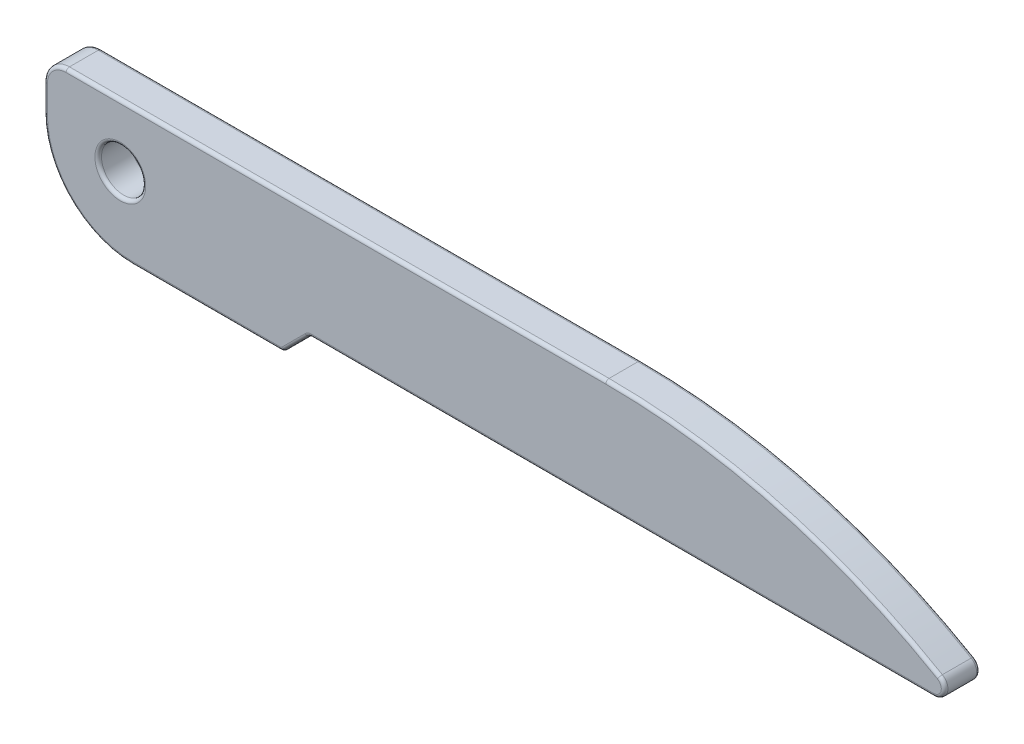
ISO-10303-21;
HEADER;
FILE_DESCRIPTION(('STEP AP214'),'2;1');
FILE_NAME('part.step','',(''),(''),'','','');
FILE_SCHEMA(('AUTOMOTIVE_DESIGN { 1 0 10303 214 1 1 1 1 }'));
ENDSEC;
DATA;
#1=APPLICATION_CONTEXT('core data for automotive mechanical design processes');
#2=APPLICATION_PROTOCOL_DEFINITION('international standard','automotive_design',2000,#1);
#3=PRODUCT_CONTEXT('',#1,'mechanical');
#4=PRODUCT('Part','Part','',(#3));
#5=PRODUCT_RELATED_PRODUCT_CATEGORY('part','',(#4));
#6=PRODUCT_DEFINITION_FORMATION('','',#4);
#7=PRODUCT_DEFINITION_CONTEXT('part definition',#1,'design');
#8=PRODUCT_DEFINITION('design','',#6,#7);
#9=PRODUCT_DEFINITION_SHAPE('','',#8);
#10=(LENGTH_UNIT() NAMED_UNIT(*) SI_UNIT(.MILLI.,.METRE.));
#11=(NAMED_UNIT(*) PLANE_ANGLE_UNIT() SI_UNIT($,.RADIAN.));
#12=(NAMED_UNIT(*) SI_UNIT($,.STERADIAN.) SOLID_ANGLE_UNIT());
#13=UNCERTAINTY_MEASURE_WITH_UNIT(LENGTH_MEASURE(1.E-05),#10,'distance_accuracy_value','');
#14=(GEOMETRIC_REPRESENTATION_CONTEXT(3) GLOBAL_UNCERTAINTY_ASSIGNED_CONTEXT((#13)) GLOBAL_UNIT_ASSIGNED_CONTEXT((#10,
#11,#12)) REPRESENTATION_CONTEXT('',''));
#15=CARTESIAN_POINT('',(0.,0.,0.));
#16=DIRECTION('',(0.,0.,1.));
#17=DIRECTION('',(1.,0.,0.));
#18=AXIS2_PLACEMENT_3D('',#15,#16,#17);
#19=CARTESIAN_POINT('',(25.416876048223,-23.8,1.6));
#20=DIRECTION('',(0.,0.,-1.));
#21=DIRECTION('',(-1.,0.,0.));
#22=AXIS2_PLACEMENT_3D('',#19,#20,#21);
#23=PLANE('',#22);
#24=CARTESIAN_POINT('',(3.45,3.4,1.6));
#25=DIRECTION('',(0.,0.,-1.));
#26=DIRECTION('',(-1.,0.,0.));
#27=AXIS2_PLACEMENT_3D('',#24,#25,#26);
#28=CIRCLE('',#27,1.15);
#29=CARTESIAN_POINT('',(2.3,3.4,1.6));
#30=VERTEX_POINT('',#29);
#31=EDGE_CURVE('E11',#30,#30,#28,.T.);
#32=ORIENTED_EDGE('',*,*,#31,.T.);
#33=EDGE_LOOP('',(#32));
#34=FACE_BOUND('',#33,.T.);
#35=CARTESIAN_POINT('',(1.,5.2,1.6));
#36=DIRECTION('',(0.,0.,-1.));
#37=DIRECTION('',(-1.,0.,0.));
#38=AXIS2_PLACEMENT_3D('',#35,#36,#37);
#39=CIRCLE('',#38,0.85);
#40=CARTESIAN_POINT('',(0.150000000000001,5.2,1.6));
#41=VERTEX_POINT('',#40);
#42=CARTESIAN_POINT('',(1.,6.05,1.6));
#43=VERTEX_POINT('',#42);
#44=EDGE_CURVE('E543',#41,#43,#39,.T.);
#45=ORIENTED_EDGE('',*,*,#44,.F.);
#46=DIRECTION('',(0.,-1.,0.));
#47=VECTOR('',#46,1.);
#48=CARTESIAN_POINT('',(0.150000000000001,-23.8,1.6));
#49=LINE('',#48,#47);
#50=CARTESIAN_POINT('',(0.150000000000001,4.,1.6));
#51=VERTEX_POINT('',#50);
#52=EDGE_CURVE('E201',#41,#51,#49,.T.);
#53=ORIENTED_EDGE('',*,*,#52,.T.);
#54=CARTESIAN_POINT('',(4.,4.,1.6));
#55=DIRECTION('',(0.,0.,-1.));
#56=DIRECTION('',(-1.,0.,0.));
#57=AXIS2_PLACEMENT_3D('',#54,#55,#56);
#58=CIRCLE('',#57,3.85);
#59=CARTESIAN_POINT('',(4.,0.150000000000001,1.6));
#60=VERTEX_POINT('',#59);
#61=EDGE_CURVE('E858',#60,#51,#58,.T.);
#62=ORIENTED_EDGE('',*,*,#61,.F.);
#63=DIRECTION('',(1.,0.,0.));
#64=VECTOR('',#63,1.);
#65=CARTESIAN_POINT('',(25.416876048223,0.150000000000001,1.6));
#66=LINE('',#65,#64);
#67=CARTESIAN_POINT('',(10.6964466094067,0.150000000000001,1.6));
#68=VERTEX_POINT('',#67);
#69=EDGE_CURVE('E297',#60,#68,#66,.T.);
#70=ORIENTED_EDGE('',*,*,#69,.T.);
#71=CARTESIAN_POINT('',(10.6964466094067,0.25,1.6));
#72=DIRECTION('',(0.,0.,-1.));
#73=DIRECTION('',(-1.,0.,0.));
#74=AXIS2_PLACEMENT_3D('',#71,#72,#73);
#75=CIRCLE('',#74,0.1);
#76=CARTESIAN_POINT('',(10.7671572875254,0.179289321881345,1.6));
#77=VERTEX_POINT('',#76);
#78=EDGE_CURVE('E299',#68,#77,#75,.F.);
#79=ORIENTED_EDGE('',*,*,#78,.T.);
#80=DIRECTION('',(0.707106781186546,0.707106781186549,0.));
#81=VECTOR('',#80,1.);
#82=CARTESIAN_POINT('',(6.1023720069335,-4.48549595871057,1.6));
#83=LINE('',#82,#81);
#84=CARTESIAN_POINT('',(11.8207106781187,1.23284271247461,1.6));
#85=VERTEX_POINT('',#84);
#86=EDGE_CURVE('E301',#77,#85,#83,.T.);
#87=ORIENTED_EDGE('',*,*,#86,.T.);
#88=CARTESIAN_POINT('',(12.1035533905933,0.949999999999996,1.6));
#89=DIRECTION('',(0.,0.,-1.));
#90=DIRECTION('',(-1.,0.,0.));
#91=AXIS2_PLACEMENT_3D('',#88,#89,#90);
#92=CIRCLE('',#91,0.4);
#93=CARTESIAN_POINT('',(12.1035533905933,1.35,1.6));
#94=VERTEX_POINT('',#93);
#95=EDGE_CURVE('E303',#85,#94,#92,.T.);
#96=ORIENTED_EDGE('',*,*,#95,.T.);
#97=DIRECTION('',(1.,0.,0.));
#98=VECTOR('',#97,1.);
#99=CARTESIAN_POINT('',(25.416876048223,1.35,1.6));
#100=LINE('',#99,#98);
#101=CARTESIAN_POINT('',(40.2492730224143,1.35,1.6));
#102=VERTEX_POINT('',#101);
#103=EDGE_CURVE('E305',#94,#102,#100,.T.);
#104=ORIENTED_EDGE('',*,*,#103,.T.);
#105=CARTESIAN_POINT('',(40.2492730224143,1.7,1.6));
#106=DIRECTION('',(0.,0.,-1.));
#107=DIRECTION('',(-1.,0.,0.));
#108=AXIS2_PLACEMENT_3D('',#105,#106,#107);
#109=CIRCLE('',#108,0.35);
#110=CARTESIAN_POINT('',(40.4252506136336,2.00254237288135,1.6));
#111=VERTEX_POINT('',#110);
#112=EDGE_CURVE('E307',#102,#111,#109,.F.);
#113=ORIENTED_EDGE('',*,*,#112,.T.);
#114=CARTESIAN_POINT('',(25.416876048223,-23.8,1.6));
#115=DIRECTION('',(0.,0.,-1.));
#116=DIRECTION('',(-1.,0.,0.));
#117=AXIS2_PLACEMENT_3D('',#114,#115,#116);
#118=CIRCLE('',#117,29.85);
#119=CARTESIAN_POINT('',(25.416876048223,6.05,1.6));
#120=VERTEX_POINT('',#119);
#121=EDGE_CURVE('E309',#111,#120,#118,.F.);
#122=ORIENTED_EDGE('',*,*,#121,.T.);
#123=DIRECTION('',(-1.,0.,0.));
#124=VECTOR('',#123,1.);
#125=CARTESIAN_POINT('',(25.416876048223,6.05,1.6));
#126=LINE('',#125,#124);
#127=EDGE_CURVE('E311',#120,#43,#126,.T.);
#128=ORIENTED_EDGE('',*,*,#127,.T.);
#129=EDGE_LOOP('',(#45,#53,#62,#70,#79,#87,#96,#104,#113,#122,#128));
#130=FACE_BOUND('',#129,.T.);
#131=ADVANCED_FACE('F36',(#34,#130),#23,.F.);
#132=CARTESIAN_POINT('',(25.416876048223,-23.8,0.));
#133=DIRECTION('',(0.,0.,-1.));
#134=DIRECTION('',(-1.,0.,0.));
#135=AXIS2_PLACEMENT_3D('',#132,#133,#134);
#136=PLANE('',#135);
#137=CARTESIAN_POINT('',(3.45,3.4,0.));
#138=DIRECTION('',(0.,0.,-1.));
#139=DIRECTION('',(-1.,0.,0.));
#140=AXIS2_PLACEMENT_3D('',#137,#138,#139);
#141=CIRCLE('',#140,1.15);
#142=CARTESIAN_POINT('',(2.3,3.4,0.));
#143=VERTEX_POINT('',#142);
#144=EDGE_CURVE('E44',#143,#143,#141,.F.);
#145=ORIENTED_EDGE('',*,*,#144,.T.);
#146=EDGE_LOOP('',(#145));
#147=FACE_BOUND('',#146,.T.);
#148=CARTESIAN_POINT('',(22.416876048223,19.2977270848675,0.));
#149=DIRECTION('',(0.,0.,-1.));
#150=DIRECTION('',(-1.,0.,0.));
#151=AXIS2_PLACEMENT_3D('',#148,#149,#150);
#152=CIRCLE('',#151,15.);
#153=CARTESIAN_POINT('',(28.416876048223,5.55,0.));
#154=VERTEX_POINT('',#153);
#155=CARTESIAN_POINT('',(16.416876048223,5.55,0.));
#156=VERTEX_POINT('',#155);
#157=EDGE_CURVE('E197',#154,#156,#152,.T.);
#158=ORIENTED_EDGE('',*,*,#157,.F.);
#159=DIRECTION('',(1.,0.,0.));
#160=VECTOR('',#159,1.);
#161=CARTESIAN_POINT('',(16.416876048223,5.55,0.));
#162=LINE('',#161,#160);
#163=EDGE_CURVE('E203',#156,#154,#162,.T.);
#164=ORIENTED_EDGE('',*,*,#163,.F.);
#165=EDGE_LOOP('',(#158,#164));
#166=FACE_BOUND('',#165,.T.);
#167=CARTESIAN_POINT('',(1.,5.2,0.));
#168=DIRECTION('',(0.,0.,-1.));
#169=DIRECTION('',(-1.,0.,0.));
#170=AXIS2_PLACEMENT_3D('',#167,#168,#169);
#171=CIRCLE('',#170,0.85);
#172=CARTESIAN_POINT('',(1.,6.05,0.));
#173=VERTEX_POINT('',#172);
#174=CARTESIAN_POINT('',(0.15,5.2,0.));
#175=VERTEX_POINT('',#174);
#176=EDGE_CURVE('E528',#173,#175,#171,.F.);
#177=ORIENTED_EDGE('',*,*,#176,.F.);
#178=DIRECTION('',(-1.,0.,0.));
#179=VECTOR('',#178,1.);
#180=CARTESIAN_POINT('',(25.416876048223,6.05,0.));
#181=LINE('',#180,#179);
#182=CARTESIAN_POINT('',(25.416876048223,6.05,0.));
#183=VERTEX_POINT('',#182);
#184=EDGE_CURVE('E248',#173,#183,#181,.F.);
#185=ORIENTED_EDGE('',*,*,#184,.T.);
#186=CARTESIAN_POINT('',(25.416876048223,-23.8,0.));
#187=DIRECTION('',(0.,0.,-1.));
#188=DIRECTION('',(-1.,0.,0.));
#189=AXIS2_PLACEMENT_3D('',#186,#187,#188);
#190=CIRCLE('',#189,29.85);
#191=CARTESIAN_POINT('',(40.4252506136336,2.00254237288136,0.));
#192=VERTEX_POINT('',#191);
#193=EDGE_CURVE('E250',#183,#192,#190,.T.);
#194=ORIENTED_EDGE('',*,*,#193,.T.);
#195=CARTESIAN_POINT('',(40.2492730224143,1.7,0.));
#196=DIRECTION('',(0.,0.,-1.));
#197=DIRECTION('',(-1.,0.,0.));
#198=AXIS2_PLACEMENT_3D('',#195,#196,#197);
#199=CIRCLE('',#198,0.35);
#200=CARTESIAN_POINT('',(40.2492730224143,1.35,0.));
#201=VERTEX_POINT('',#200);
#202=EDGE_CURVE('E252',#192,#201,#199,.T.);
#203=ORIENTED_EDGE('',*,*,#202,.T.);
#204=DIRECTION('',(1.,0.,0.));
#205=VECTOR('',#204,1.);
#206=CARTESIAN_POINT('',(12.1035533905933,1.35,0.));
#207=LINE('',#206,#205);
#208=CARTESIAN_POINT('',(12.1035533905933,1.35,0.));
#209=VERTEX_POINT('',#208);
#210=EDGE_CURVE('E254',#201,#209,#207,.F.);
#211=ORIENTED_EDGE('',*,*,#210,.T.);
#212=CARTESIAN_POINT('',(12.1035533905933,0.949999999999996,0.));
#213=DIRECTION('',(0.,0.,-1.));
#214=DIRECTION('',(-1.,0.,0.));
#215=AXIS2_PLACEMENT_3D('',#212,#213,#214);
#216=CIRCLE('',#215,0.4);
#217=CARTESIAN_POINT('',(11.8207106781187,1.23284271247461,0.));
#218=VERTEX_POINT('',#217);
#219=EDGE_CURVE('E256',#209,#218,#216,.F.);
#220=ORIENTED_EDGE('',*,*,#219,.T.);
#221=DIRECTION('',(0.707106781186546,0.707106781186549,0.));
#222=VECTOR('',#221,1.);
#223=CARTESIAN_POINT('',(10.7671572875254,0.179289321881346,0.));
#224=LINE('',#223,#222);
#225=CARTESIAN_POINT('',(10.7671572875254,0.179289321881346,0.));
#226=VERTEX_POINT('',#225);
#227=EDGE_CURVE('E238',#218,#226,#224,.F.);
#228=ORIENTED_EDGE('',*,*,#227,.T.);
#229=CARTESIAN_POINT('',(10.6964466094067,0.25,0.));
#230=DIRECTION('',(0.,0.,-1.));
#231=DIRECTION('',(-1.,0.,0.));
#232=AXIS2_PLACEMENT_3D('',#229,#230,#231);
#233=CIRCLE('',#232,0.1);
#234=CARTESIAN_POINT('',(10.6964466094067,0.15,0.));
#235=VERTEX_POINT('',#234);
#236=EDGE_CURVE('E240',#226,#235,#233,.T.);
#237=ORIENTED_EDGE('',*,*,#236,.T.);
#238=DIRECTION('',(1.,0.,0.));
#239=VECTOR('',#238,1.);
#240=CARTESIAN_POINT('',(0.,0.15,0.));
#241=LINE('',#240,#239);
#242=CARTESIAN_POINT('',(4.,0.15,0.));
#243=VERTEX_POINT('',#242);
#244=EDGE_CURVE('E242',#235,#243,#241,.F.);
#245=ORIENTED_EDGE('',*,*,#244,.T.);
#246=CARTESIAN_POINT('',(4.,4.,0.));
#247=DIRECTION('',(0.,0.,-1.));
#248=DIRECTION('',(-1.,0.,0.));
#249=AXIS2_PLACEMENT_3D('',#246,#247,#248);
#250=CIRCLE('',#249,3.85);
#251=CARTESIAN_POINT('',(0.15,4.,0.));
#252=VERTEX_POINT('',#251);
#253=EDGE_CURVE('E200',#252,#243,#250,.F.);
#254=ORIENTED_EDGE('',*,*,#253,.F.);
#255=DIRECTION('',(0.,-1.,0.));
#256=VECTOR('',#255,1.);
#257=CARTESIAN_POINT('',(0.15,6.2,0.));
#258=LINE('',#257,#256);
#259=EDGE_CURVE('E245',#252,#175,#258,.F.);
#260=ORIENTED_EDGE('',*,*,#259,.T.);
#261=EDGE_LOOP('',(#177,#185,#194,#203,#211,#220,#228,#237,#245,#254,#260));
#262=FACE_BOUND('',#261,.T.);
#263=ADVANCED_FACE('F208',(#147,#166,#262),#136,.T.);
#264=CARTESIAN_POINT('',(10.8,0.,1.6));
#265=DIRECTION('',(0.,1.,0.));
#266=DIRECTION('',(-1.,0.,0.));
#267=AXIS2_PLACEMENT_3D('',#264,#265,#266);
#268=PLANE('',#267);
#269=DIRECTION('',(1.,0.,0.));
#270=VECTOR('',#269,1.);
#271=CARTESIAN_POINT('',(10.8,0.,1.45));
#272=LINE('',#271,#270);
#273=CARTESIAN_POINT('',(10.6964466094067,0.,1.45));
#274=VERTEX_POINT('',#273);
#275=CARTESIAN_POINT('',(4.,0.,1.45));
#276=VERTEX_POINT('',#275);
#277=EDGE_CURVE('E284',#274,#276,#272,.F.);
#278=ORIENTED_EDGE('',*,*,#277,.T.);
#279=DIRECTION('',(0.,0.,-1.));
#280=VECTOR('',#279,1.);
#281=CARTESIAN_POINT('',(4.,0.,1.6));
#282=LINE('',#281,#280);
#283=CARTESIAN_POINT('',(4.,0.,0.15));
#284=VERTEX_POINT('',#283);
#285=EDGE_CURVE('E538',#276,#284,#282,.T.);
#286=ORIENTED_EDGE('',*,*,#285,.T.);
#287=DIRECTION('',(1.,0.,0.));
#288=VECTOR('',#287,1.);
#289=CARTESIAN_POINT('',(10.6964466094067,0.,0.15));
#290=LINE('',#289,#288);
#291=CARTESIAN_POINT('',(10.6964466094067,0.,0.15));
#292=VERTEX_POINT('',#291);
#293=EDGE_CURVE('E287',#284,#292,#290,.T.);
#294=ORIENTED_EDGE('',*,*,#293,.T.);
#295=DIRECTION('',(0.,0.,-1.));
#296=VECTOR('',#295,1.);
#297=CARTESIAN_POINT('',(10.6964466094067,0.,1.6));
#298=LINE('',#297,#296);
#299=EDGE_CURVE('E232',#292,#274,#298,.F.);
#300=ORIENTED_EDGE('',*,*,#299,.T.);
#301=EDGE_LOOP('',(#278,#286,#294,#300));
#302=FACE_BOUND('',#301,.T.);
#303=ADVANCED_FACE('F374',(#302),#268,.F.);
#304=CARTESIAN_POINT('',(12.,1.2,1.6));
#305=DIRECTION('',(-0.707106781186549,0.707106781186546,0.));
#306=DIRECTION('',(-0.707106781186546,-0.707106781186549,0.));
#307=AXIS2_PLACEMENT_3D('',#304,#305,#306);
#308=PLANE('',#307);
#309=DIRECTION('',(0.,0.,-1.));
#310=VECTOR('',#309,1.);
#311=CARTESIAN_POINT('',(10.8732233047034,0.073223304703364,1.6));
#312=LINE('',#311,#310);
#313=CARTESIAN_POINT('',(10.8732233047034,0.073223304703364,1.45));
#314=VERTEX_POINT('',#313);
#315=CARTESIAN_POINT('',(10.8732233047034,0.073223304703364,0.15));
#316=VERTEX_POINT('',#315);
#317=EDGE_CURVE('E229',#314,#316,#312,.T.);
#318=ORIENTED_EDGE('',*,*,#317,.T.);
#319=DIRECTION('',(0.707106781186546,0.707106781186549,0.));
#320=VECTOR('',#319,1.);
#321=CARTESIAN_POINT('',(11.9267766952966,1.12677669529663,0.15));
#322=LINE('',#321,#320);
#323=CARTESIAN_POINT('',(11.9267766952966,1.12677669529663,0.15));
#324=VERTEX_POINT('',#323);
#325=EDGE_CURVE('E295',#316,#324,#322,.T.);
#326=ORIENTED_EDGE('',*,*,#325,.T.);
#327=DIRECTION('',(0.,0.,-1.));
#328=VECTOR('',#327,1.);
#329=CARTESIAN_POINT('',(11.9267766952966,1.12677669529663,1.6));
#330=LINE('',#329,#328);
#331=CARTESIAN_POINT('',(11.9267766952966,1.12677669529663,1.45));
#332=VERTEX_POINT('',#331);
#333=EDGE_CURVE('E226',#324,#332,#330,.F.);
#334=ORIENTED_EDGE('',*,*,#333,.T.);
#335=DIRECTION('',(0.707106781186546,0.707106781186549,0.));
#336=VECTOR('',#335,1.);
#337=CARTESIAN_POINT('',(12.,1.2,1.45));
#338=LINE('',#337,#336);
#339=EDGE_CURVE('E293',#332,#314,#338,.F.);
#340=ORIENTED_EDGE('',*,*,#339,.T.);
#341=EDGE_LOOP('',(#318,#326,#334,#340));
#342=FACE_BOUND('',#341,.T.);
#343=ADVANCED_FACE('F392',(#342),#308,.F.);
#344=CARTESIAN_POINT('',(42.,1.2,1.6));
#345=DIRECTION('',(0.,1.,0.));
#346=DIRECTION('',(-1.,0.,0.));
#347=AXIS2_PLACEMENT_3D('',#344,#345,#346);
#348=PLANE('',#347);
#349=DIRECTION('',(0.,0.,-1.));
#350=VECTOR('',#349,1.);
#351=CARTESIAN_POINT('',(12.1035533905933,1.2,0.));
#352=LINE('',#351,#350);
#353=CARTESIAN_POINT('',(12.1035533905933,1.2,1.45));
#354=VERTEX_POINT('',#353);
#355=CARTESIAN_POINT('',(12.1035533905933,1.2,0.15));
#356=VERTEX_POINT('',#355);
#357=EDGE_CURVE('E235',#354,#356,#352,.T.);
#358=ORIENTED_EDGE('',*,*,#357,.T.);
#359=DIRECTION('',(1.,0.,0.));
#360=VECTOR('',#359,1.);
#361=CARTESIAN_POINT('',(40.2492730224143,1.2,0.15));
#362=LINE('',#361,#360);
#363=CARTESIAN_POINT('',(40.2492730224143,1.2,0.15));
#364=VERTEX_POINT('',#363);
#365=EDGE_CURVE('E266',#356,#364,#362,.T.);
#366=ORIENTED_EDGE('',*,*,#365,.T.);
#367=DIRECTION('',(0.,0.,-1.));
#368=VECTOR('',#367,1.);
#369=CARTESIAN_POINT('',(40.2492730224143,1.2,1.6));
#370=LINE('',#369,#368);
#371=CARTESIAN_POINT('',(40.2492730224143,1.2,1.45));
#372=VERTEX_POINT('',#371);
#373=EDGE_CURVE('E223',#364,#372,#370,.F.);
#374=ORIENTED_EDGE('',*,*,#373,.T.);
#375=DIRECTION('',(1.,0.,0.));
#376=VECTOR('',#375,1.);
#377=CARTESIAN_POINT('',(42.,1.2,1.45));
#378=LINE('',#377,#376);
#379=EDGE_CURVE('E264',#372,#354,#378,.F.);
#380=ORIENTED_EDGE('',*,*,#379,.T.);
#381=EDGE_LOOP('',(#358,#366,#374,#380));
#382=FACE_BOUND('',#381,.T.);
#383=ADVANCED_FACE('F388',(#382),#348,.F.);
#384=CARTESIAN_POINT('',(25.416876048223,-23.8,1.6));
#385=DIRECTION('',(0.,0.,-1.));
#386=DIRECTION('',(-1.,0.,0.));
#387=AXIS2_PLACEMENT_3D('',#384,#385,#386);
#388=CYLINDRICAL_SURFACE('',#387,30.);
#389=DIRECTION('',(0.,0.,-1.));
#390=VECTOR('',#389,1.);
#391=CARTESIAN_POINT('',(40.5006695812989,2.13220338983051,1.6));
#392=LINE('',#391,#390);
#393=CARTESIAN_POINT('',(40.5006695812989,2.13220338983051,1.45));
#394=VERTEX_POINT('',#393);
#395=CARTESIAN_POINT('',(40.5006695812989,2.13220338983051,0.15));
#396=VERTEX_POINT('',#395);
#397=EDGE_CURVE('E219',#394,#396,#392,.T.);
#398=ORIENTED_EDGE('',*,*,#397,.T.);
#399=CARTESIAN_POINT('',(25.416876048223,-23.8,0.15));
#400=DIRECTION('',(0.,0.,-1.));
#401=DIRECTION('',(-1.,0.,0.));
#402=AXIS2_PLACEMENT_3D('',#399,#400,#401);
#403=CIRCLE('',#402,30.);
#404=CARTESIAN_POINT('',(25.416876048223,6.2,0.15));
#405=VERTEX_POINT('',#404);
#406=EDGE_CURVE('E274',#396,#405,#403,.F.);
#407=ORIENTED_EDGE('',*,*,#406,.T.);
#408=DIRECTION('',(0.,0.,-1.));
#409=VECTOR('',#408,1.);
#410=CARTESIAN_POINT('',(25.416876048223,6.2,1.6));
#411=LINE('',#410,#409);
#412=CARTESIAN_POINT('',(25.416876048223,6.2,1.45));
#413=VERTEX_POINT('',#412);
#414=EDGE_CURVE('E216',#413,#405,#411,.T.);
#415=ORIENTED_EDGE('',*,*,#414,.F.);
#416=CARTESIAN_POINT('',(25.416876048223,-23.8,1.45));
#417=DIRECTION('',(0.,0.,-1.));
#418=DIRECTION('',(-1.,0.,0.));
#419=AXIS2_PLACEMENT_3D('',#416,#417,#418);
#420=CIRCLE('',#419,30.);
#421=EDGE_CURVE('E272',#413,#394,#420,.T.);
#422=ORIENTED_EDGE('',*,*,#421,.T.);
#423=EDGE_LOOP('',(#398,#407,#415,#422));
#424=FACE_BOUND('',#423,.T.);
#425=ADVANCED_FACE('F384',(#424),#388,.T.);
#426=CARTESIAN_POINT('',(0.,6.2,1.6));
#427=DIRECTION('',(0.,-1.,0.));
#428=DIRECTION('',(1.,0.,0.));
#429=AXIS2_PLACEMENT_3D('',#426,#427,#428);
#430=PLANE('',#429);
#431=DIRECTION('',(-1.,0.,0.));
#432=VECTOR('',#431,1.);
#433=CARTESIAN_POINT('',(0.,6.2,0.15));
#434=LINE('',#433,#432);
#435=CARTESIAN_POINT('',(1.,6.2,0.15));
#436=VERTEX_POINT('',#435);
#437=EDGE_CURVE('E278',#405,#436,#434,.T.);
#438=ORIENTED_EDGE('',*,*,#437,.T.);
#439=DIRECTION('',(0.,0.,-1.));
#440=VECTOR('',#439,1.);
#441=CARTESIAN_POINT('',(1.,6.2,1.6));
#442=LINE('',#441,#440);
#443=CARTESIAN_POINT('',(1.,6.2,1.45));
#444=VERTEX_POINT('',#443);
#445=EDGE_CURVE('E550',#436,#444,#442,.F.);
#446=ORIENTED_EDGE('',*,*,#445,.T.);
#447=DIRECTION('',(-1.,0.,0.));
#448=VECTOR('',#447,1.);
#449=CARTESIAN_POINT('',(0.,6.2,1.45));
#450=LINE('',#449,#448);
#451=EDGE_CURVE('E276',#444,#413,#450,.F.);
#452=ORIENTED_EDGE('',*,*,#451,.T.);
#453=ORIENTED_EDGE('',*,*,#414,.T.);
#454=EDGE_LOOP('',(#438,#446,#452,#453));
#455=FACE_BOUND('',#454,.T.);
#456=ADVANCED_FACE('F380',(#455),#430,.F.);
#457=CARTESIAN_POINT('',(0.,0.,1.6));
#458=DIRECTION('',(1.,0.,0.));
#459=DIRECTION('',(0.,0.,-1.));
#460=AXIS2_PLACEMENT_3D('',#457,#458,#459);
#461=PLANE('',#460);
#462=DIRECTION('',(0.,-1.,0.));
#463=VECTOR('',#462,1.);
#464=CARTESIAN_POINT('',(0.,0.,1.45));
#465=LINE('',#464,#463);
#466=CARTESIAN_POINT('',(0.,4.,1.45));
#467=VERTEX_POINT('',#466);
#468=CARTESIAN_POINT('',(0.,5.2,1.45));
#469=VERTEX_POINT('',#468);
#470=EDGE_CURVE('E280',#467,#469,#465,.F.);
#471=ORIENTED_EDGE('',*,*,#470,.T.);
#472=DIRECTION('',(0.,0.,-1.));
#473=VECTOR('',#472,1.);
#474=CARTESIAN_POINT('',(0.,5.2,1.6));
#475=LINE('',#474,#473);
#476=CARTESIAN_POINT('',(0.,5.2,0.15));
#477=VERTEX_POINT('',#476);
#478=EDGE_CURVE('E548',#469,#477,#475,.T.);
#479=ORIENTED_EDGE('',*,*,#478,.T.);
#480=DIRECTION('',(0.,-1.,0.));
#481=VECTOR('',#480,1.);
#482=CARTESIAN_POINT('',(0.,0.,0.15));
#483=LINE('',#482,#481);
#484=CARTESIAN_POINT('',(0.,4.,0.15));
#485=VERTEX_POINT('',#484);
#486=EDGE_CURVE('E282',#477,#485,#483,.T.);
#487=ORIENTED_EDGE('',*,*,#486,.T.);
#488=DIRECTION('',(0.,0.,-1.));
#489=VECTOR('',#488,1.);
#490=CARTESIAN_POINT('',(0.,4.,1.6));
#491=LINE('',#490,#489);
#492=EDGE_CURVE('E534',#485,#467,#491,.F.);
#493=ORIENTED_EDGE('',*,*,#492,.T.);
#494=EDGE_LOOP('',(#471,#479,#487,#493));
#495=FACE_BOUND('',#494,.T.);
#496=ADVANCED_FACE('F376',(#495),#461,.F.);
#497=CARTESIAN_POINT('',(40.2492730224143,1.7,1.6));
#498=DIRECTION('',(0.,0.,-1.));
#499=DIRECTION('',(-1.,0.,0.));
#500=AXIS2_PLACEMENT_3D('',#497,#498,#499);
#501=CYLINDRICAL_SURFACE('',#500,0.5);
#502=ORIENTED_EDGE('',*,*,#373,.F.);
#503=CARTESIAN_POINT('',(40.2492730224143,1.7,0.15));
#504=DIRECTION('',(0.,0.,-1.));
#505=DIRECTION('',(-1.,0.,0.));
#506=AXIS2_PLACEMENT_3D('',#503,#504,#505);
#507=CIRCLE('',#506,0.5);
#508=EDGE_CURVE('E270',#364,#396,#507,.F.);
#509=ORIENTED_EDGE('',*,*,#508,.T.);
#510=ORIENTED_EDGE('',*,*,#397,.F.);
#511=CARTESIAN_POINT('',(40.2492730224143,1.7,1.45));
#512=DIRECTION('',(0.,0.,-1.));
#513=DIRECTION('',(-1.,0.,0.));
#514=AXIS2_PLACEMENT_3D('',#511,#512,#513);
#515=CIRCLE('',#514,0.5);
#516=EDGE_CURVE('E268',#394,#372,#515,.T.);
#517=ORIENTED_EDGE('',*,*,#516,.T.);
#518=EDGE_LOOP('',(#502,#509,#510,#517));
#519=FACE_BOUND('',#518,.T.);
#520=ADVANCED_FACE('F379',(#519),#501,.T.);
#521=CARTESIAN_POINT('',(10.6964466094067,0.25,1.6));
#522=DIRECTION('',(0.,0.,-1.));
#523=DIRECTION('',(-1.,0.,0.));
#524=AXIS2_PLACEMENT_3D('',#521,#522,#523);
#525=CYLINDRICAL_SURFACE('',#524,0.25);
#526=ORIENTED_EDGE('',*,*,#299,.F.);
#527=CARTESIAN_POINT('',(10.6964466094067,0.25,0.15));
#528=DIRECTION('',(0.,0.,-1.));
#529=DIRECTION('',(-1.,0.,0.));
#530=AXIS2_PLACEMENT_3D('',#527,#528,#529);
#531=CIRCLE('',#530,0.25);
#532=EDGE_CURVE('E291',#292,#316,#531,.F.);
#533=ORIENTED_EDGE('',*,*,#532,.T.);
#534=ORIENTED_EDGE('',*,*,#317,.F.);
#535=CARTESIAN_POINT('',(10.6964466094067,0.25,1.45));
#536=DIRECTION('',(0.,0.,-1.));
#537=DIRECTION('',(-1.,0.,0.));
#538=AXIS2_PLACEMENT_3D('',#535,#536,#537);
#539=CIRCLE('',#538,0.25);
#540=EDGE_CURVE('E289',#314,#274,#539,.T.);
#541=ORIENTED_EDGE('',*,*,#540,.T.);
#542=EDGE_LOOP('',(#526,#533,#534,#541));
#543=FACE_BOUND('',#542,.T.);
#544=ADVANCED_FACE('F402',(#543),#525,.T.);
#545=CARTESIAN_POINT('',(12.1035533905933,0.949999999999996,1.6));
#546=DIRECTION('',(0.,0.,1.));
#547=DIRECTION('',(1.,0.,0.));
#548=AXIS2_PLACEMENT_3D('',#545,#546,#547);
#549=CYLINDRICAL_SURFACE('',#548,0.25);
#550=ORIENTED_EDGE('',*,*,#333,.F.);
#551=CARTESIAN_POINT('',(12.1035533905933,0.949999999999996,0.15));
#552=DIRECTION('',(0.,0.,-1.));
#553=DIRECTION('',(-1.,0.,0.));
#554=AXIS2_PLACEMENT_3D('',#551,#552,#553);
#555=CIRCLE('',#554,0.25);
#556=EDGE_CURVE('E261',#324,#356,#555,.T.);
#557=ORIENTED_EDGE('',*,*,#556,.T.);
#558=ORIENTED_EDGE('',*,*,#357,.F.);
#559=CARTESIAN_POINT('',(12.1035533905933,0.949999999999996,1.45));
#560=DIRECTION('',(0.,0.,-1.));
#561=DIRECTION('',(-1.,0.,0.));
#562=AXIS2_PLACEMENT_3D('',#559,#560,#561);
#563=CIRCLE('',#562,0.25);
#564=EDGE_CURVE('E259',#354,#332,#563,.F.);
#565=ORIENTED_EDGE('',*,*,#564,.T.);
#566=EDGE_LOOP('',(#550,#557,#558,#565));
#567=FACE_BOUND('',#566,.T.);
#568=ADVANCED_FACE('F406',(#567),#549,.F.);
#569=CARTESIAN_POINT('',(0.,6.05,0.15));
#570=DIRECTION('',(1.,0.,0.));
#571=DIRECTION('',(0.,1.,0.));
#572=AXIS2_PLACEMENT_3D('',#569,#570,#571);
#573=CYLINDRICAL_SURFACE('',#572,0.15);
#574=ORIENTED_EDGE('',*,*,#184,.F.);
#575=CARTESIAN_POINT('',(1.,6.05,0.15));
#576=DIRECTION('',(1.,0.,0.));
#577=DIRECTION('',(0.,0.,-1.));
#578=AXIS2_PLACEMENT_3D('',#575,#576,#577);
#579=CIRCLE('',#578,0.15);
#580=EDGE_CURVE('E51',#173,#436,#579,.T.);
#581=ORIENTED_EDGE('',*,*,#580,.T.);
#582=ORIENTED_EDGE('',*,*,#437,.F.);
#583=CARTESIAN_POINT('',(25.416876048223,6.05,0.15));
#584=DIRECTION('',(1.,0.,0.));
#585=DIRECTION('',(0.,0.,-1.));
#586=AXIS2_PLACEMENT_3D('',#583,#584,#585);
#587=CIRCLE('',#586,0.15);
#588=EDGE_CURVE('E220',#183,#405,#587,.T.);
#589=ORIENTED_EDGE('',*,*,#588,.F.);
#590=EDGE_LOOP('',(#574,#581,#582,#589));
#591=FACE_BOUND('',#590,.T.);
#592=ADVANCED_FACE('F410',(#591),#573,.T.);
#593=CARTESIAN_POINT('',(0.15,0.,0.15));
#594=DIRECTION('',(0.,1.,0.));
#595=DIRECTION('',(0.,0.,1.));
#596=AXIS2_PLACEMENT_3D('',#593,#594,#595);
#597=CYLINDRICAL_SURFACE('',#596,0.15);
#598=ORIENTED_EDGE('',*,*,#486,.F.);
#599=CARTESIAN_POINT('',(0.15,5.2,0.15));
#600=DIRECTION('',(0.,-1.,0.));
#601=DIRECTION('',(0.,0.,-1.));
#602=AXIS2_PLACEMENT_3D('',#599,#600,#601);
#603=CIRCLE('',#602,0.15);
#604=EDGE_CURVE('E533',#477,#175,#603,.T.);
#605=ORIENTED_EDGE('',*,*,#604,.T.);
#606=ORIENTED_EDGE('',*,*,#259,.F.);
#607=CARTESIAN_POINT('',(0.15,4.,0.15));
#608=DIRECTION('',(0.,1.,0.));
#609=DIRECTION('',(0.,0.,1.));
#610=AXIS2_PLACEMENT_3D('',#607,#608,#609);
#611=CIRCLE('',#610,0.15);
#612=EDGE_CURVE('E869',#252,#485,#611,.T.);
#613=ORIENTED_EDGE('',*,*,#612,.T.);
#614=EDGE_LOOP('',(#598,#605,#606,#613));
#615=FACE_BOUND('',#614,.T.);
#616=ADVANCED_FACE('F440',(#615),#597,.T.);
#617=CARTESIAN_POINT('',(25.416876048223,-23.8,0.15));
#618=DIRECTION('',(0.,0.,-1.));
#619=DIRECTION('',(-1.,0.,0.));
#620=AXIS2_PLACEMENT_3D('',#617,#618,#619);
#621=TOROIDAL_SURFACE('',#620,29.85,0.15);
#622=ORIENTED_EDGE('',*,*,#588,.T.);
#623=ORIENTED_EDGE('',*,*,#406,.F.);
#624=CARTESIAN_POINT('',(40.4252506136336,2.00254237288136,0.15));
#625=DIRECTION('',(0.864406779661014,-0.502793117769202,0.));
#626=DIRECTION('',(0.502793117769202,0.864406779661014,0.));
#627=AXIS2_PLACEMENT_3D('',#624,#625,#626);
#628=CIRCLE('',#627,0.15);
#629=EDGE_CURVE('E329',#192,#396,#628,.T.);
#630=ORIENTED_EDGE('',*,*,#629,.F.);
#631=ORIENTED_EDGE('',*,*,#193,.F.);
#632=EDGE_LOOP('',(#622,#623,#630,#631));
#633=FACE_BOUND('',#632,.T.);
#634=ADVANCED_FACE('F436',(#633),#621,.T.);
#635=CARTESIAN_POINT('',(10.8,0.15,0.15));
#636=DIRECTION('',(-1.,0.,0.));
#637=DIRECTION('',(0.,-1.,0.));
#638=AXIS2_PLACEMENT_3D('',#635,#636,#637);
#639=CYLINDRICAL_SURFACE('',#638,0.15);
#640=ORIENTED_EDGE('',*,*,#293,.F.);
#641=CARTESIAN_POINT('',(4.,0.15,0.15));
#642=DIRECTION('',(1.,0.,0.));
#643=DIRECTION('',(0.,0.,-1.));
#644=AXIS2_PLACEMENT_3D('',#641,#642,#643);
#645=CIRCLE('',#644,0.15);
#646=EDGE_CURVE('E864',#284,#243,#645,.T.);
#647=ORIENTED_EDGE('',*,*,#646,.T.);
#648=ORIENTED_EDGE('',*,*,#244,.F.);
#649=CARTESIAN_POINT('',(10.6964466094067,0.15,0.15));
#650=DIRECTION('',(1.,0.,0.));
#651=DIRECTION('',(0.,0.,-1.));
#652=AXIS2_PLACEMENT_3D('',#649,#650,#651);
#653=CIRCLE('',#652,0.15);
#654=EDGE_CURVE('E326',#292,#235,#653,.T.);
#655=ORIENTED_EDGE('',*,*,#654,.F.);
#656=EDGE_LOOP('',(#640,#647,#648,#655));
#657=FACE_BOUND('',#656,.T.);
#658=ADVANCED_FACE('F432',(#657),#639,.T.);
#659=CARTESIAN_POINT('',(40.2492730224143,1.7,0.15));
#660=DIRECTION('',(0.,0.,-1.));
#661=DIRECTION('',(-1.,0.,0.));
#662=AXIS2_PLACEMENT_3D('',#659,#660,#661);
#663=TOROIDAL_SURFACE('',#662,0.35,0.15);
#664=ORIENTED_EDGE('',*,*,#629,.T.);
#665=ORIENTED_EDGE('',*,*,#508,.F.);
#666=CARTESIAN_POINT('',(40.2492730224143,1.35,0.15));
#667=DIRECTION('',(-1.,0.,0.));
#668=DIRECTION('',(0.,0.,1.));
#669=AXIS2_PLACEMENT_3D('',#666,#667,#668);
#670=CIRCLE('',#669,0.15);
#671=EDGE_CURVE('E323',#201,#364,#670,.T.);
#672=ORIENTED_EDGE('',*,*,#671,.F.);
#673=ORIENTED_EDGE('',*,*,#202,.F.);
#674=EDGE_LOOP('',(#664,#665,#672,#673));
#675=FACE_BOUND('',#674,.T.);
#676=ADVANCED_FACE('F428',(#675),#663,.T.);
#677=CARTESIAN_POINT('',(10.6964466094067,0.25,0.15));
#678=DIRECTION('',(0.,0.,-1.));
#679=DIRECTION('',(-1.,0.,0.));
#680=AXIS2_PLACEMENT_3D('',#677,#678,#679);
#681=DEGENERATE_TOROIDAL_SURFACE('',#680,0.1,0.15,.T.);
#682=ORIENTED_EDGE('',*,*,#654,.T.);
#683=ORIENTED_EDGE('',*,*,#236,.F.);
#684=CARTESIAN_POINT('',(10.7671572875254,0.179289321881346,0.15));
#685=DIRECTION('',(0.707106781186542,0.707106781186553,0.));
#686=DIRECTION('',(-0.707106781186553,0.707106781186542,0.));
#687=AXIS2_PLACEMENT_3D('',#684,#685,#686);
#688=CIRCLE('',#687,0.15);
#689=EDGE_CURVE('E320',#316,#226,#688,.T.);
#690=ORIENTED_EDGE('',*,*,#689,.F.);
#691=ORIENTED_EDGE('',*,*,#532,.F.);
#692=EDGE_LOOP('',(#682,#683,#690,#691));
#693=FACE_BOUND('',#692,.T.);
#694=ADVANCED_FACE('F424',(#693),#681,.T.);
#695=CARTESIAN_POINT('',(42.,1.35,0.15));
#696=DIRECTION('',(-1.,0.,0.));
#697=DIRECTION('',(0.,-1.,0.));
#698=AXIS2_PLACEMENT_3D('',#695,#696,#697);
#699=CYLINDRICAL_SURFACE('',#698,0.15);
#700=ORIENTED_EDGE('',*,*,#671,.T.);
#701=ORIENTED_EDGE('',*,*,#365,.F.);
#702=CARTESIAN_POINT('',(12.1035533905933,1.35,0.15));
#703=DIRECTION('',(-1.,0.,0.));
#704=DIRECTION('',(0.,0.,1.));
#705=AXIS2_PLACEMENT_3D('',#702,#703,#704);
#706=CIRCLE('',#705,0.15);
#707=EDGE_CURVE('E317',#209,#356,#706,.T.);
#708=ORIENTED_EDGE('',*,*,#707,.F.);
#709=ORIENTED_EDGE('',*,*,#210,.F.);
#710=EDGE_LOOP('',(#700,#701,#708,#709));
#711=FACE_BOUND('',#710,.T.);
#712=ADVANCED_FACE('F420',(#711),#699,.T.);
#713=CARTESIAN_POINT('',(11.893933982822,1.30606601717798,0.15));
#714=DIRECTION('',(-0.707106781186546,-0.707106781186549,0.));
#715=DIRECTION('',(0.707106781186549,-0.707106781186546,0.));
#716=AXIS2_PLACEMENT_3D('',#713,#714,#715);
#717=CYLINDRICAL_SURFACE('',#716,0.15);
#718=ORIENTED_EDGE('',*,*,#689,.T.);
#719=ORIENTED_EDGE('',*,*,#227,.F.);
#720=CARTESIAN_POINT('',(11.8207106781187,1.23284271247461,0.15));
#721=DIRECTION('',(0.707106781186543,0.707106781186552,0.));
#722=DIRECTION('',(-0.707106781186552,0.707106781186543,0.));
#723=AXIS2_PLACEMENT_3D('',#720,#721,#722);
#724=CIRCLE('',#723,0.15);
#725=EDGE_CURVE('E315',#324,#218,#724,.T.);
#726=ORIENTED_EDGE('',*,*,#725,.F.);
#727=ORIENTED_EDGE('',*,*,#325,.F.);
#728=EDGE_LOOP('',(#718,#719,#726,#727));
#729=FACE_BOUND('',#728,.T.);
#730=ADVANCED_FACE('F416',(#729),#717,.T.);
#731=CARTESIAN_POINT('',(12.1035533905933,0.949999999999996,0.15));
#732=DIRECTION('',(0.,0.,-1.));
#733=DIRECTION('',(-1.,0.,0.));
#734=AXIS2_PLACEMENT_3D('',#731,#732,#733);
#735=TOROIDAL_SURFACE('',#734,0.4,0.15);
#736=ORIENTED_EDGE('',*,*,#707,.T.);
#737=ORIENTED_EDGE('',*,*,#556,.F.);
#738=ORIENTED_EDGE('',*,*,#725,.T.);
#739=ORIENTED_EDGE('',*,*,#219,.F.);
#740=EDGE_LOOP('',(#736,#737,#738,#739));
#741=FACE_BOUND('',#740,.T.);
#742=ADVANCED_FACE('F412',(#741),#735,.T.);
#743=CARTESIAN_POINT('',(25.416876048223,1.35,1.45));
#744=DIRECTION('',(1.,0.,0.));
#745=DIRECTION('',(0.,1.,0.));
#746=AXIS2_PLACEMENT_3D('',#743,#744,#745);
#747=CYLINDRICAL_SURFACE('',#746,0.15);
#748=CARTESIAN_POINT('',(40.2492730224143,1.35,1.45));
#749=DIRECTION('',(1.,0.,0.));
#750=DIRECTION('',(0.,0.,-1.));
#751=AXIS2_PLACEMENT_3D('',#748,#749,#750);
#752=CIRCLE('',#751,0.15);
#753=EDGE_CURVE('E348',#102,#372,#752,.T.);
#754=ORIENTED_EDGE('',*,*,#753,.F.);
#755=ORIENTED_EDGE('',*,*,#103,.F.);
#756=CARTESIAN_POINT('',(12.1035533905933,1.35,1.45));
#757=DIRECTION('',(-1.,0.,0.));
#758=DIRECTION('',(0.,0.,1.));
#759=AXIS2_PLACEMENT_3D('',#756,#757,#758);
#760=CIRCLE('',#759,0.15);
#761=EDGE_CURVE('E318',#354,#94,#760,.T.);
#762=ORIENTED_EDGE('',*,*,#761,.F.);
#763=ORIENTED_EDGE('',*,*,#379,.F.);
#764=EDGE_LOOP('',(#754,#755,#762,#763));
#765=FACE_BOUND('',#764,.T.);
#766=ADVANCED_FACE('F415',(#765),#747,.T.);
#767=CARTESIAN_POINT('',(12.1035533905933,0.949999999999996,1.45));
#768=DIRECTION('',(0.,0.,-1.));
#769=DIRECTION('',(-1.,0.,0.));
#770=AXIS2_PLACEMENT_3D('',#767,#768,#769);
#771=TOROIDAL_SURFACE('',#770,0.4,0.15);
#772=ORIENTED_EDGE('',*,*,#761,.T.);
#773=ORIENTED_EDGE('',*,*,#95,.F.);
#774=CARTESIAN_POINT('',(11.8207106781187,1.23284271247461,1.45));
#775=DIRECTION('',(-0.707106781186543,-0.707106781186553,0.));
#776=DIRECTION('',(0.707106781186553,-0.707106781186543,0.));
#777=AXIS2_PLACEMENT_3D('',#774,#775,#776);
#778=CIRCLE('',#777,0.15);
#779=EDGE_CURVE('E345',#332,#85,#778,.T.);
#780=ORIENTED_EDGE('',*,*,#779,.F.);
#781=ORIENTED_EDGE('',*,*,#564,.F.);
#782=EDGE_LOOP('',(#772,#773,#780,#781));
#783=FACE_BOUND('',#782,.T.);
#784=ADVANCED_FACE('F472',(#783),#771,.T.);
#785=CARTESIAN_POINT('',(40.2492730224143,1.7,1.45));
#786=DIRECTION('',(0.,0.,-1.));
#787=DIRECTION('',(-1.,0.,0.));
#788=AXIS2_PLACEMENT_3D('',#785,#786,#787);
#789=TOROIDAL_SURFACE('',#788,0.35,0.15);
#790=ORIENTED_EDGE('',*,*,#753,.T.);
#791=ORIENTED_EDGE('',*,*,#516,.F.);
#792=CARTESIAN_POINT('',(40.4252506136336,2.00254237288135,1.45));
#793=DIRECTION('',(-0.864406779661018,0.502793117769196,0.));
#794=DIRECTION('',(-0.502793117769196,-0.864406779661018,0.));
#795=AXIS2_PLACEMENT_3D('',#792,#793,#794);
#796=CIRCLE('',#795,0.15);
#797=EDGE_CURVE('E342',#111,#394,#796,.T.);
#798=ORIENTED_EDGE('',*,*,#797,.F.);
#799=ORIENTED_EDGE('',*,*,#112,.F.);
#800=EDGE_LOOP('',(#790,#791,#798,#799));
#801=FACE_BOUND('',#800,.T.);
#802=ADVANCED_FACE('F468',(#801),#789,.T.);
#803=CARTESIAN_POINT('',(6.10237200693349,-4.48549595871057,1.45));
#804=DIRECTION('',(0.707106781186546,0.707106781186549,0.));
#805=DIRECTION('',(-0.707106781186549,0.707106781186546,0.));
#806=AXIS2_PLACEMENT_3D('',#803,#804,#805);
#807=CYLINDRICAL_SURFACE('',#806,0.15);
#808=ORIENTED_EDGE('',*,*,#779,.T.);
#809=ORIENTED_EDGE('',*,*,#86,.F.);
#810=CARTESIAN_POINT('',(10.7671572875254,0.179289321881346,1.45));
#811=DIRECTION('',(-0.707106781186543,-0.707106781186552,0.));
#812=DIRECTION('',(0.707106781186552,-0.707106781186543,0.));
#813=AXIS2_PLACEMENT_3D('',#810,#811,#812);
#814=CIRCLE('',#813,0.15);
#815=EDGE_CURVE('E339',#314,#77,#814,.T.);
#816=ORIENTED_EDGE('',*,*,#815,.F.);
#817=ORIENTED_EDGE('',*,*,#339,.F.);
#818=EDGE_LOOP('',(#808,#809,#816,#817));
#819=FACE_BOUND('',#818,.T.);
#820=ADVANCED_FACE('F464',(#819),#807,.T.);
#821=CARTESIAN_POINT('',(25.416876048223,-23.8,1.45));
#822=DIRECTION('',(0.,0.,-1.));
#823=DIRECTION('',(-1.,0.,0.));
#824=AXIS2_PLACEMENT_3D('',#821,#822,#823);
#825=TOROIDAL_SURFACE('',#824,29.85,0.15);
#826=ORIENTED_EDGE('',*,*,#797,.T.);
#827=ORIENTED_EDGE('',*,*,#421,.F.);
#828=CARTESIAN_POINT('',(25.416876048223,6.05,1.45));
#829=DIRECTION('',(-1.,0.,0.));
#830=DIRECTION('',(0.,0.,1.));
#831=AXIS2_PLACEMENT_3D('',#828,#829,#830);
#832=CIRCLE('',#831,0.15);
#833=EDGE_CURVE('E336',#120,#413,#832,.T.);
#834=ORIENTED_EDGE('',*,*,#833,.F.);
#835=ORIENTED_EDGE('',*,*,#121,.F.);
#836=EDGE_LOOP('',(#826,#827,#834,#835));
#837=FACE_BOUND('',#836,.T.);
#838=ADVANCED_FACE('F460',(#837),#825,.T.);
#839=CARTESIAN_POINT('',(10.6964466094067,0.25,1.45));
#840=DIRECTION('',(0.,0.,-1.));
#841=DIRECTION('',(-1.,0.,0.));
#842=AXIS2_PLACEMENT_3D('',#839,#840,#841);
#843=DEGENERATE_TOROIDAL_SURFACE('',#842,0.1,0.15,.T.);
#844=ORIENTED_EDGE('',*,*,#815,.T.);
#845=ORIENTED_EDGE('',*,*,#78,.F.);
#846=CARTESIAN_POINT('',(10.6964466094067,0.15,1.45));
#847=DIRECTION('',(-1.,0.,0.));
#848=DIRECTION('',(0.,0.,1.));
#849=AXIS2_PLACEMENT_3D('',#846,#847,#848);
#850=CIRCLE('',#849,0.15);
#851=EDGE_CURVE('E206',#274,#68,#850,.T.);
#852=ORIENTED_EDGE('',*,*,#851,.F.);
#853=ORIENTED_EDGE('',*,*,#540,.F.);
#854=EDGE_LOOP('',(#844,#845,#852,#853));
#855=FACE_BOUND('',#854,.T.);
#856=ADVANCED_FACE('F456',(#855),#843,.T.);
#857=CARTESIAN_POINT('',(25.416876048223,6.05,1.45));
#858=DIRECTION('',(-1.,0.,0.));
#859=DIRECTION('',(0.,-1.,0.));
#860=AXIS2_PLACEMENT_3D('',#857,#858,#859);
#861=CYLINDRICAL_SURFACE('',#860,0.15);
#862=ORIENTED_EDGE('',*,*,#451,.F.);
#863=CARTESIAN_POINT('',(1.,6.05,1.45));
#864=DIRECTION('',(1.,0.,0.));
#865=DIRECTION('',(0.,0.,-1.));
#866=AXIS2_PLACEMENT_3D('',#863,#864,#865);
#867=CIRCLE('',#866,0.15);
#868=EDGE_CURVE('E536',#444,#43,#867,.T.);
#869=ORIENTED_EDGE('',*,*,#868,.T.);
#870=ORIENTED_EDGE('',*,*,#127,.F.);
#871=ORIENTED_EDGE('',*,*,#833,.T.);
#872=EDGE_LOOP('',(#862,#869,#870,#871));
#873=FACE_BOUND('',#872,.T.);
#874=ADVANCED_FACE('F452',(#873),#861,.T.);
#875=CARTESIAN_POINT('',(25.416876048223,0.150000000000001,1.45));
#876=DIRECTION('',(1.,0.,0.));
#877=DIRECTION('',(0.,1.,0.));
#878=AXIS2_PLACEMENT_3D('',#875,#876,#877);
#879=CYLINDRICAL_SURFACE('',#878,0.15);
#880=ORIENTED_EDGE('',*,*,#69,.F.);
#881=CARTESIAN_POINT('',(4.,0.150000000000001,1.45));
#882=DIRECTION('',(1.,0.,0.));
#883=DIRECTION('',(0.,0.,-1.));
#884=AXIS2_PLACEMENT_3D('',#881,#882,#883);
#885=CIRCLE('',#884,0.15);
#886=EDGE_CURVE('E862',#60,#276,#885,.T.);
#887=ORIENTED_EDGE('',*,*,#886,.T.);
#888=ORIENTED_EDGE('',*,*,#277,.F.);
#889=ORIENTED_EDGE('',*,*,#851,.T.);
#890=EDGE_LOOP('',(#880,#887,#888,#889));
#891=FACE_BOUND('',#890,.T.);
#892=ADVANCED_FACE('F449',(#891),#879,.T.);
#893=CARTESIAN_POINT('',(0.150000000000001,-23.8,1.45));
#894=DIRECTION('',(0.,-1.,0.));
#895=DIRECTION('',(0.,0.,-1.));
#896=AXIS2_PLACEMENT_3D('',#893,#894,#895);
#897=CYLINDRICAL_SURFACE('',#896,0.15);
#898=ORIENTED_EDGE('',*,*,#52,.F.);
#899=CARTESIAN_POINT('',(0.150000000000001,5.2,1.45));
#900=DIRECTION('',(0.,-1.,0.));
#901=DIRECTION('',(0.,0.,-1.));
#902=AXIS2_PLACEMENT_3D('',#899,#900,#901);
#903=CIRCLE('',#902,0.15);
#904=EDGE_CURVE('E59',#41,#469,#903,.T.);
#905=ORIENTED_EDGE('',*,*,#904,.T.);
#906=ORIENTED_EDGE('',*,*,#470,.F.);
#907=CARTESIAN_POINT('',(0.15,4.,1.45));
#908=DIRECTION('',(0.,1.,0.));
#909=DIRECTION('',(0.,0.,1.));
#910=AXIS2_PLACEMENT_3D('',#907,#908,#909);
#911=CIRCLE('',#910,0.15);
#912=EDGE_CURVE('E861',#467,#51,#911,.T.);
#913=ORIENTED_EDGE('',*,*,#912,.T.);
#914=EDGE_LOOP('',(#898,#905,#906,#913));
#915=FACE_BOUND('',#914,.T.);
#916=ADVANCED_FACE('F367',(#915),#897,.T.);
#917=CARTESIAN_POINT('',(16.416876048223,5.55,0.3));
#918=DIRECTION('',(0.,1.,0.));
#919=DIRECTION('',(-1.,0.,0.));
#920=AXIS2_PLACEMENT_3D('',#917,#918,#919);
#921=PLANE('',#920);
#922=ORIENTED_EDGE('',*,*,#163,.T.);
#923=CARTESIAN_POINT('',(28.416876048223,5.55,0.));
#924=CARTESIAN_POINT('',(28.2928350326775,5.55,0.0203768617587796));
#925=CARTESIAN_POINT('',(28.1685353825166,5.55,0.0391081696066672));
#926=CARTESIAN_POINT('',(27.9195453604894,5.55,0.0736267353848329));
#927=CARTESIAN_POINT('',(27.7948550494396,5.55,0.0894144304593562));
#928=CARTESIAN_POINT('',(27.4205166812348,5.55,0.132869415126505));
#929=CARTESIAN_POINT('',(27.1704178482243,5.55,0.156657635105015));
#930=CARTESIAN_POINT('',(26.6701271411419,5.55,0.196280412123994));
#931=CARTESIAN_POINT('',(26.4199364475546,5.55,0.212130738211363));
#932=CARTESIAN_POINT('',(25.9192143116364,5.55,0.238017795477217));
#933=CARTESIAN_POINT('',(25.6686828093724,5.55,0.248053319650755));
#934=CARTESIAN_POINT('',(25.1681736036836,5.55,0.264011091901368));
#935=CARTESIAN_POINT('',(24.9181962265308,5.55,0.269944348002578));
#936=CARTESIAN_POINT('',(24.41819084978,5.55,0.279107873409892));
#937=CARTESIAN_POINT('',(24.1681628492525,5.55,0.282338087521644));
#938=CARTESIAN_POINT('',(23.6679292848188,5.55,0.287098802929965));
#939=CARTESIAN_POINT('',(23.4177237115558,5.55,0.288628193188929));
#940=CARTESIAN_POINT('',(22.9173041083164,5.55,0.290598323876838));
#941=CARTESIAN_POINT('',(22.6670900782697,5.55,0.291039043690195));
#942=CARTESIAN_POINT('',(22.1666620181763,5.55,0.291039043690195));
#943=CARTESIAN_POINT('',(21.9164479881296,5.55,0.290598323876837));
#944=CARTESIAN_POINT('',(21.4160283848903,5.55,0.288628193188928));
#945=CARTESIAN_POINT('',(21.1658228116272,5.55,0.287098802929965));
#946=CARTESIAN_POINT('',(20.6655892471935,5.55,0.282338087521644));
#947=CARTESIAN_POINT('',(20.415561246666,5.55,0.279107873409892));
#948=CARTESIAN_POINT('',(19.9155558699152,5.55,0.269944348002577));
#949=CARTESIAN_POINT('',(19.6655784927624,5.55,0.264011091901368));
#950=CARTESIAN_POINT('',(19.1650692870736,5.55,0.248053319650755));
#951=CARTESIAN_POINT('',(18.9145377848096,5.55,0.238017795477216));
#952=CARTESIAN_POINT('',(18.4138156488914,5.55,0.212130738211362));
#953=CARTESIAN_POINT('',(18.1636249553041,5.55,0.196280412123993));
#954=CARTESIAN_POINT('',(17.6633342482217,5.55,0.156657635105015));
#955=CARTESIAN_POINT('',(17.4132354152112,5.55,0.132869415126506));
#956=CARTESIAN_POINT('',(17.0388970470064,5.55,0.0894144304593555));
#957=CARTESIAN_POINT('',(16.9142067359566,5.55,0.0736267353848316));
#958=CARTESIAN_POINT('',(16.6652167139294,5.55,0.0391081696066657));
#959=CARTESIAN_POINT('',(16.5409170637685,5.55,0.0203768617587783));
#960=CARTESIAN_POINT('',(16.416876048223,5.55,0.));
#961=B_SPLINE_CURVE_WITH_KNOTS('',3,(#923,#924,#925,#926,#927,#928,#929,#930,#931,#932,#933,
#934,#935,#936,#937,#938,#939,#940,#941,#942,#943,#944,#945,#946,#947,#948,#949,#950,#951,#952,
#953,#954,#955,#956,#957,#958,#959,#960),.UNSPECIFIED.,.F.,.F.,(4,2,2,2,2,2,2,2,2,2,2,2,2,2,2,2,
2,2,4),(0.,0.377081921232816,0.754107798846084,1.50760317242971,2.25959569024526,
3.01174424670837,3.76186657193619,4.51200421379838,5.26263158448771,6.01327316930969,
6.76391475413167,7.514542124821,8.2646797666832,9.01480209191101,9.76695064837413,
10.5189431661897,11.2724385397733,11.6494644173866,12.0265463386194),.UNSPECIFIED.);
#962=EDGE_CURVE('E193',#154,#156,#961,.T.);
#963=ORIENTED_EDGE('',*,*,#962,.T.);
#964=EDGE_LOOP('',(#922,#963));
#965=FACE_BOUND('',#964,.T.);
#966=ADVANCED_FACE('F204',(#965),#921,.F.);
#967=CARTESIAN_POINT('',(22.416876048223,19.2977270848675,-3.7));
#968=DIRECTION('',(0.,0.,1.));
#969=DIRECTION('',(1.,0.,0.));
#970=AXIS2_PLACEMENT_3D('',#967,#968,#969);
#971=TOROIDAL_SURFACE('',#970,13.4801315846429,4.);
#972=ORIENTED_EDGE('',*,*,#962,.F.);
#973=ORIENTED_EDGE('',*,*,#157,.T.);
#974=EDGE_LOOP('',(#972,#973));
#975=FACE_BOUND('',#974,.T.);
#976=ADVANCED_FACE('F195',(#975),#971,.F.);
#977=CARTESIAN_POINT('',(3.45,3.4,1.6));
#978=DIRECTION('',(0.,0.,-1.));
#979=DIRECTION('',(-1.,0.,0.));
#980=AXIS2_PLACEMENT_3D('',#977,#978,#979);
#981=CYLINDRICAL_SURFACE('',#980,1.);
#982=CARTESIAN_POINT('',(3.45,3.4,0.15));
#983=DIRECTION('',(0.,0.,-1.));
#984=DIRECTION('',(-1.,0.,0.));
#985=AXIS2_PLACEMENT_3D('',#982,#983,#984);
#986=CIRCLE('',#985,1.);
#987=CARTESIAN_POINT('',(2.45,3.4,0.15));
#988=VERTEX_POINT('',#987);
#989=EDGE_CURVE('E561',#988,#988,#986,.T.);
#990=ORIENTED_EDGE('',*,*,#989,.T.);
#991=EDGE_LOOP('',(#990));
#992=FACE_BOUND('',#991,.T.);
#993=CARTESIAN_POINT('',(3.45,3.4,1.45));
#994=DIRECTION('',(0.,0.,-1.));
#995=DIRECTION('',(-1.,0.,0.));
#996=AXIS2_PLACEMENT_3D('',#993,#994,#995);
#997=CIRCLE('',#996,1.);
#998=CARTESIAN_POINT('',(2.45,3.4,1.45));
#999=VERTEX_POINT('',#998);
#1000=EDGE_CURVE('E552',#999,#999,#997,.F.);
#1001=ORIENTED_EDGE('',*,*,#1000,.T.);
#1002=EDGE_LOOP('',(#1001));
#1003=FACE_BOUND('',#1002,.T.);
#1004=ADVANCED_FACE('F368',(#992,#1003),#981,.F.);
#1005=CARTESIAN_POINT('',(4.,4.,1.45));
#1006=DIRECTION('',(0.,0.,-1.));
#1007=DIRECTION('',(-1.,0.,0.));
#1008=AXIS2_PLACEMENT_3D('',#1005,#1006,#1007);
#1009=TOROIDAL_SURFACE('',#1008,3.85,0.15);
#1010=ORIENTED_EDGE('',*,*,#61,.T.);
#1011=ORIENTED_EDGE('',*,*,#912,.F.);
#1012=CARTESIAN_POINT('',(4.,4.,1.45));
#1013=DIRECTION('',(0.,0.,-1.));
#1014=DIRECTION('',(-1.,0.,0.));
#1015=AXIS2_PLACEMENT_3D('',#1012,#1013,#1014);
#1016=CIRCLE('',#1015,4.);
#1017=EDGE_CURVE('E210',#276,#467,#1016,.T.);
#1018=ORIENTED_EDGE('',*,*,#1017,.F.);
#1019=ORIENTED_EDGE('',*,*,#886,.F.);
#1020=EDGE_LOOP('',(#1010,#1011,#1018,#1019));
#1021=FACE_BOUND('',#1020,.T.);
#1022=ADVANCED_FACE('F574',(#1021),#1009,.T.);
#1023=CARTESIAN_POINT('',(4.,4.,1.6));
#1024=DIRECTION('',(0.,0.,-1.));
#1025=DIRECTION('',(-1.,0.,0.));
#1026=AXIS2_PLACEMENT_3D('',#1023,#1024,#1025);
#1027=CYLINDRICAL_SURFACE('',#1026,4.);
#1028=ORIENTED_EDGE('',*,*,#1017,.T.);
#1029=ORIENTED_EDGE('',*,*,#492,.F.);
#1030=CARTESIAN_POINT('',(4.,4.,0.15));
#1031=DIRECTION('',(0.,0.,-1.));
#1032=DIRECTION('',(-1.,0.,0.));
#1033=AXIS2_PLACEMENT_3D('',#1030,#1031,#1032);
#1034=CIRCLE('',#1033,4.);
#1035=EDGE_CURVE('E213',#284,#485,#1034,.T.);
#1036=ORIENTED_EDGE('',*,*,#1035,.F.);
#1037=ORIENTED_EDGE('',*,*,#285,.F.);
#1038=EDGE_LOOP('',(#1028,#1029,#1036,#1037));
#1039=FACE_BOUND('',#1038,.T.);
#1040=ADVANCED_FACE('F618',(#1039),#1027,.T.);
#1041=CARTESIAN_POINT('',(4.,4.,0.15));
#1042=DIRECTION('',(0.,0.,-1.));
#1043=DIRECTION('',(-1.,0.,0.));
#1044=AXIS2_PLACEMENT_3D('',#1041,#1042,#1043);
#1045=TOROIDAL_SURFACE('',#1044,3.85,0.15);
#1046=ORIENTED_EDGE('',*,*,#612,.F.);
#1047=ORIENTED_EDGE('',*,*,#253,.T.);
#1048=ORIENTED_EDGE('',*,*,#646,.F.);
#1049=ORIENTED_EDGE('',*,*,#1035,.T.);
#1050=EDGE_LOOP('',(#1046,#1047,#1048,#1049));
#1051=FACE_BOUND('',#1050,.T.);
#1052=ADVANCED_FACE('F609',(#1051),#1045,.T.);
#1053=CARTESIAN_POINT('',(1.,5.2,1.45));
#1054=DIRECTION('',(0.,0.,-1.));
#1055=DIRECTION('',(-1.,0.,0.));
#1056=AXIS2_PLACEMENT_3D('',#1053,#1054,#1055);
#1057=TOROIDAL_SURFACE('',#1056,0.85,0.15);
#1058=ORIENTED_EDGE('',*,*,#44,.T.);
#1059=ORIENTED_EDGE('',*,*,#868,.F.);
#1060=CARTESIAN_POINT('',(1.,5.2,1.45));
#1061=DIRECTION('',(0.,0.,-1.));
#1062=DIRECTION('',(-1.,0.,0.));
#1063=AXIS2_PLACEMENT_3D('',#1060,#1061,#1062);
#1064=CIRCLE('',#1063,1.);
#1065=EDGE_CURVE('E556',#469,#444,#1064,.T.);
#1066=ORIENTED_EDGE('',*,*,#1065,.F.);
#1067=ORIENTED_EDGE('',*,*,#904,.F.);
#1068=EDGE_LOOP('',(#1058,#1059,#1066,#1067));
#1069=FACE_BOUND('',#1068,.T.);
#1070=ADVANCED_FACE('F601',(#1069),#1057,.T.);
#1071=CARTESIAN_POINT('',(1.,5.2,1.6));
#1072=DIRECTION('',(0.,0.,-1.));
#1073=DIRECTION('',(-1.,0.,0.));
#1074=AXIS2_PLACEMENT_3D('',#1071,#1072,#1073);
#1075=CYLINDRICAL_SURFACE('',#1074,1.);
#1076=ORIENTED_EDGE('',*,*,#1065,.T.);
#1077=ORIENTED_EDGE('',*,*,#445,.F.);
#1078=CARTESIAN_POINT('',(1.,5.2,0.15));
#1079=DIRECTION('',(0.,0.,-1.));
#1080=DIRECTION('',(-1.,0.,0.));
#1081=AXIS2_PLACEMENT_3D('',#1078,#1079,#1080);
#1082=CIRCLE('',#1081,1.);
#1083=EDGE_CURVE('E553',#477,#436,#1082,.T.);
#1084=ORIENTED_EDGE('',*,*,#1083,.F.);
#1085=ORIENTED_EDGE('',*,*,#478,.F.);
#1086=EDGE_LOOP('',(#1076,#1077,#1084,#1085));
#1087=FACE_BOUND('',#1086,.T.);
#1088=ADVANCED_FACE('F593',(#1087),#1075,.T.);
#1089=CARTESIAN_POINT('',(1.,5.2,0.15));
#1090=DIRECTION('',(0.,0.,-1.));
#1091=DIRECTION('',(-1.,0.,0.));
#1092=AXIS2_PLACEMENT_3D('',#1089,#1090,#1091);
#1093=TOROIDAL_SURFACE('',#1092,0.85,0.15);
#1094=ORIENTED_EDGE('',*,*,#580,.F.);
#1095=ORIENTED_EDGE('',*,*,#176,.T.);
#1096=ORIENTED_EDGE('',*,*,#604,.F.);
#1097=ORIENTED_EDGE('',*,*,#1083,.T.);
#1098=EDGE_LOOP('',(#1094,#1095,#1096,#1097));
#1099=FACE_BOUND('',#1098,.T.);
#1100=ADVANCED_FACE('F569',(#1099),#1093,.T.);
#1101=CARTESIAN_POINT('',(3.45,3.4,0.15));
#1102=DIRECTION('',(0.,0.,-1.));
#1103=DIRECTION('',(-1.,0.,0.));
#1104=AXIS2_PLACEMENT_3D('',#1101,#1102,#1103);
#1105=TOROIDAL_SURFACE('',#1104,1.15,0.15);
#1106=ORIENTED_EDGE('',*,*,#144,.F.);
#1107=EDGE_LOOP('',(#1106));
#1108=FACE_BOUND('',#1107,.T.);
#1109=ORIENTED_EDGE('',*,*,#989,.F.);
#1110=EDGE_LOOP('',(#1109));
#1111=FACE_BOUND('',#1110,.T.);
#1112=ADVANCED_FACE('F566',(#1108,#1111),#1105,.T.);
#1113=CARTESIAN_POINT('',(3.45,3.4,1.45));
#1114=DIRECTION('',(0.,0.,-1.));
#1115=DIRECTION('',(-1.,0.,0.));
#1116=AXIS2_PLACEMENT_3D('',#1113,#1114,#1115);
#1117=TOROIDAL_SURFACE('',#1116,1.15,0.15);
#1118=ORIENTED_EDGE('',*,*,#1000,.F.);
#1119=EDGE_LOOP('',(#1118));
#1120=FACE_BOUND('',#1119,.T.);
#1121=ORIENTED_EDGE('',*,*,#31,.F.);
#1122=EDGE_LOOP('',(#1121));
#1123=FACE_BOUND('',#1122,.T.);
#1124=ADVANCED_FACE('F38',(#1120,#1123),#1117,.T.);
#1125=CLOSED_SHELL('',(#131,#263,#303,#343,#383,#425,#456,#496,#520,#544,#568,#592,#616,#634,
#658,#676,#694,#712,#730,#742,#766,#784,#802,#820,#838,#856,#874,#892,#916,#966,#976,#1004,
#1022,#1040,#1052,#1070,#1088,#1100,#1112,#1124));
#1126=MANIFOLD_SOLID_BREP('B2',#1125);
#1127=ADVANCED_BREP_SHAPE_REPRESENTATION('',(#18,#1126),#14);
#1128=SHAPE_DEFINITION_REPRESENTATION(#9,#1127);
ENDSEC;
END-ISO-10303-21;
